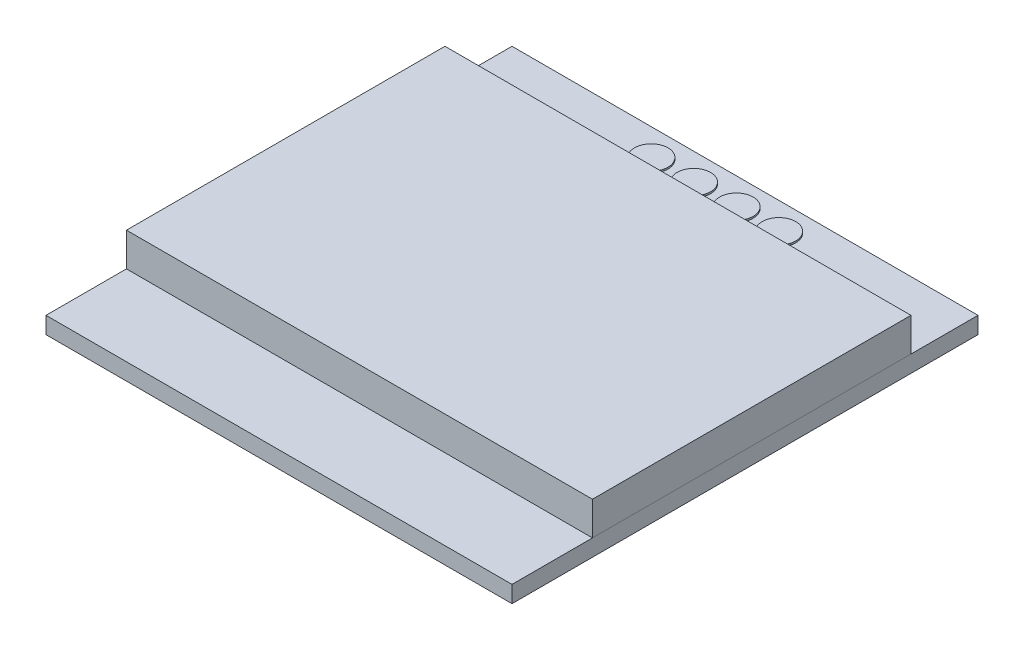
ISO-10303-21;
HEADER;
FILE_DESCRIPTION(('STEP AP214'),'2;1');
FILE_NAME('part.step','',(''),(''),'','','');
FILE_SCHEMA(('AUTOMOTIVE_DESIGN { 1 0 10303 214 1 1 1 1 }'));
ENDSEC;
DATA;
#1=APPLICATION_CONTEXT('core data for automotive mechanical design processes');
#2=APPLICATION_PROTOCOL_DEFINITION('international standard','automotive_design',2000,#1);
#3=PRODUCT_CONTEXT('',#1,'mechanical');
#4=PRODUCT('Part','Part','',(#3));
#5=PRODUCT_RELATED_PRODUCT_CATEGORY('part','',(#4));
#6=PRODUCT_DEFINITION_FORMATION('','',#4);
#7=PRODUCT_DEFINITION_CONTEXT('part definition',#1,'design');
#8=PRODUCT_DEFINITION('design','',#6,#7);
#9=PRODUCT_DEFINITION_SHAPE('','',#8);
#10=(LENGTH_UNIT() NAMED_UNIT(*) SI_UNIT(.MILLI.,.METRE.));
#11=(NAMED_UNIT(*) PLANE_ANGLE_UNIT() SI_UNIT($,.RADIAN.));
#12=(NAMED_UNIT(*) SI_UNIT($,.STERADIAN.) SOLID_ANGLE_UNIT());
#13=UNCERTAINTY_MEASURE_WITH_UNIT(LENGTH_MEASURE(1.E-05),#10,'distance_accuracy_value','');
#14=(GEOMETRIC_REPRESENTATION_CONTEXT(3) GLOBAL_UNCERTAINTY_ASSIGNED_CONTEXT((#13)) GLOBAL_UNIT_ASSIGNED_CONTEXT((#10,
#11,#12)) REPRESENTATION_CONTEXT('',''));
#15=CARTESIAN_POINT('',(0.,0.,0.));
#16=DIRECTION('',(0.,0.,1.));
#17=DIRECTION('',(1.,0.,0.));
#18=AXIS2_PLACEMENT_3D('',#15,#16,#17);
#19=CARTESIAN_POINT('',(17.62,1.1,-26.1068522600922));
#20=DIRECTION('',(0.,-1.,0.));
#21=DIRECTION('',(0.,0.,-1.));
#22=AXIS2_PLACEMENT_3D('',#19,#20,#21);
#23=CYLINDRICAL_SURFACE('',#22,1.);
#24=CARTESIAN_POINT('',(17.62,1.1,-26.1068522600922));
#25=DIRECTION('',(0.,1.,0.));
#26=DIRECTION('',(0.,0.,1.));
#27=AXIS2_PLACEMENT_3D('',#24,#25,#26);
#28=CIRCLE('',#27,1.);
#29=CARTESIAN_POINT('',(17.62,1.1,-25.1068522600922));
#30=VERTEX_POINT('',#29);
#31=EDGE_CURVE('E11',#30,#30,#28,.T.);
#32=ORIENTED_EDGE('',*,*,#31,.F.);
#33=EDGE_LOOP('',(#32));
#34=FACE_BOUND('',#33,.T.);
#35=CARTESIAN_POINT('',(17.62,1.,-26.1068522600922));
#36=DIRECTION('',(0.,1.,0.));
#37=DIRECTION('',(0.,0.,1.));
#38=AXIS2_PLACEMENT_3D('',#35,#36,#37);
#39=CIRCLE('',#38,1.);
#40=CARTESIAN_POINT('',(17.62,1.,-25.1068522600922));
#41=VERTEX_POINT('',#40);
#42=EDGE_CURVE('E45',#41,#41,#39,.T.);
#43=ORIENTED_EDGE('',*,*,#42,.T.);
#44=EDGE_LOOP('',(#43));
#45=FACE_BOUND('',#44,.T.);
#46=ADVANCED_FACE('F42',(#34,#45),#23,.T.);
#47=CARTESIAN_POINT('',(17.62,1.1,-26.1068522600922));
#48=DIRECTION('',(0.,1.,0.));
#49=DIRECTION('',(0.,0.,1.));
#50=AXIS2_PLACEMENT_3D('',#47,#48,#49);
#51=PLANE('',#50);
#52=ORIENTED_EDGE('',*,*,#31,.T.);
#53=EDGE_LOOP('',(#52));
#54=FACE_BOUND('',#53,.T.);
#55=ADVANCED_FACE('F57',(#54),#51,.T.);
#56=CARTESIAN_POINT('',(17.62,1.,-26.1068522600922));
#57=DIRECTION('',(0.,1.,0.));
#58=DIRECTION('',(0.,0.,1.));
#59=AXIS2_PLACEMENT_3D('',#56,#57,#58);
#60=PLANE('',#59);
#61=ORIENTED_EDGE('',*,*,#42,.F.);
#62=EDGE_LOOP('',(#61));
#63=FACE_BOUND('',#62,.T.);
#64=ADVANCED_FACE('F55',(#63),#60,.F.);
#65=CLOSED_SHELL('',(#46,#55,#64));
#66=MANIFOLD_SOLID_BREP('B2',#65);
#67=CARTESIAN_POINT('',(15.08,1.1,-26.1068522600922));
#68=DIRECTION('',(0.,-1.,0.));
#69=DIRECTION('',(0.,0.,-1.));
#70=AXIS2_PLACEMENT_3D('',#67,#68,#69);
#71=CYLINDRICAL_SURFACE('',#70,1.);
#72=CARTESIAN_POINT('',(15.08,1.1,-26.1068522600922));
#73=DIRECTION('',(0.,1.,0.));
#74=DIRECTION('',(0.,0.,1.));
#75=AXIS2_PLACEMENT_3D('',#72,#73,#74);
#76=CIRCLE('',#75,1.);
#77=CARTESIAN_POINT('',(15.08,1.1,-25.1068522600922));
#78=VERTEX_POINT('',#77);
#79=EDGE_CURVE('E41',#78,#78,#76,.T.);
#80=ORIENTED_EDGE('',*,*,#79,.F.);
#81=EDGE_LOOP('',(#80));
#82=FACE_BOUND('',#81,.T.);
#83=CARTESIAN_POINT('',(15.08,1.,-26.1068522600922));
#84=DIRECTION('',(0.,1.,0.));
#85=DIRECTION('',(0.,0.,1.));
#86=AXIS2_PLACEMENT_3D('',#83,#84,#85);
#87=CIRCLE('',#86,1.);
#88=CARTESIAN_POINT('',(15.08,1.,-25.1068522600922));
#89=VERTEX_POINT('',#88);
#90=EDGE_CURVE('E94',#89,#89,#87,.T.);
#91=ORIENTED_EDGE('',*,*,#90,.T.);
#92=EDGE_LOOP('',(#91));
#93=FACE_BOUND('',#92,.T.);
#94=ADVANCED_FACE('F91',(#82,#93),#71,.T.);
#95=CARTESIAN_POINT('',(15.08,1.1,-26.1068522600922));
#96=DIRECTION('',(0.,1.,0.));
#97=DIRECTION('',(0.,0.,1.));
#98=AXIS2_PLACEMENT_3D('',#95,#96,#97);
#99=PLANE('',#98);
#100=ORIENTED_EDGE('',*,*,#79,.T.);
#101=EDGE_LOOP('',(#100));
#102=FACE_BOUND('',#101,.T.);
#103=ADVANCED_FACE('F106',(#102),#99,.T.);
#104=CARTESIAN_POINT('',(15.08,1.,-26.1068522600922));
#105=DIRECTION('',(0.,1.,0.));
#106=DIRECTION('',(0.,0.,1.));
#107=AXIS2_PLACEMENT_3D('',#104,#105,#106);
#108=PLANE('',#107);
#109=ORIENTED_EDGE('',*,*,#90,.F.);
#110=EDGE_LOOP('',(#109));
#111=FACE_BOUND('',#110,.T.);
#112=ADVANCED_FACE('F104',(#111),#108,.F.);
#113=CLOSED_SHELL('',(#94,#103,#112));
#114=MANIFOLD_SOLID_BREP('B6',#113);
#115=CARTESIAN_POINT('',(12.54,1.1,-26.1068522600922));
#116=DIRECTION('',(0.,-1.,0.));
#117=DIRECTION('',(0.,0.,-1.));
#118=AXIS2_PLACEMENT_3D('',#115,#116,#117);
#119=CYLINDRICAL_SURFACE('',#118,1.);
#120=CARTESIAN_POINT('',(12.54,1.1,-26.1068522600922));
#121=DIRECTION('',(0.,1.,0.));
#122=DIRECTION('',(0.,0.,1.));
#123=AXIS2_PLACEMENT_3D('',#120,#121,#122);
#124=CIRCLE('',#123,1.);
#125=CARTESIAN_POINT('',(12.54,1.1,-25.1068522600922));
#126=VERTEX_POINT('',#125);
#127=EDGE_CURVE('E90',#126,#126,#124,.T.);
#128=ORIENTED_EDGE('',*,*,#127,.F.);
#129=EDGE_LOOP('',(#128));
#130=FACE_BOUND('',#129,.T.);
#131=CARTESIAN_POINT('',(12.54,1.,-26.1068522600922));
#132=DIRECTION('',(0.,1.,0.));
#133=DIRECTION('',(0.,0.,1.));
#134=AXIS2_PLACEMENT_3D('',#131,#132,#133);
#135=CIRCLE('',#134,1.);
#136=CARTESIAN_POINT('',(12.54,1.,-25.1068522600922));
#137=VERTEX_POINT('',#136);
#138=EDGE_CURVE('E143',#137,#137,#135,.T.);
#139=ORIENTED_EDGE('',*,*,#138,.T.);
#140=EDGE_LOOP('',(#139));
#141=FACE_BOUND('',#140,.T.);
#142=ADVANCED_FACE('F140',(#130,#141),#119,.T.);
#143=CARTESIAN_POINT('',(12.54,1.1,-26.1068522600922));
#144=DIRECTION('',(0.,1.,0.));
#145=DIRECTION('',(0.,0.,1.));
#146=AXIS2_PLACEMENT_3D('',#143,#144,#145);
#147=PLANE('',#146);
#148=ORIENTED_EDGE('',*,*,#127,.T.);
#149=EDGE_LOOP('',(#148));
#150=FACE_BOUND('',#149,.T.);
#151=ADVANCED_FACE('F155',(#150),#147,.T.);
#152=CARTESIAN_POINT('',(12.54,1.,-26.1068522600922));
#153=DIRECTION('',(0.,1.,0.));
#154=DIRECTION('',(0.,0.,1.));
#155=AXIS2_PLACEMENT_3D('',#152,#153,#154);
#156=PLANE('',#155);
#157=ORIENTED_EDGE('',*,*,#138,.F.);
#158=EDGE_LOOP('',(#157));
#159=FACE_BOUND('',#158,.T.);
#160=ADVANCED_FACE('F153',(#159),#156,.F.);
#161=CLOSED_SHELL('',(#142,#151,#160));
#162=MANIFOLD_SOLID_BREP('B36',#161);
#163=CARTESIAN_POINT('',(10.,1.1,-26.1068522600922));
#164=DIRECTION('',(0.,-1.,0.));
#165=DIRECTION('',(0.,0.,-1.));
#166=AXIS2_PLACEMENT_3D('',#163,#164,#165);
#167=CYLINDRICAL_SURFACE('',#166,1.);
#168=CARTESIAN_POINT('',(10.,1.1,-26.1068522600922));
#169=DIRECTION('',(0.,1.,0.));
#170=DIRECTION('',(0.,0.,1.));
#171=AXIS2_PLACEMENT_3D('',#168,#169,#170);
#172=CIRCLE('',#171,1.);
#173=CARTESIAN_POINT('',(10.,1.1,-25.1068522600922));
#174=VERTEX_POINT('',#173);
#175=EDGE_CURVE('E139',#174,#174,#172,.T.);
#176=ORIENTED_EDGE('',*,*,#175,.F.);
#177=EDGE_LOOP('',(#176));
#178=FACE_BOUND('',#177,.T.);
#179=CARTESIAN_POINT('',(10.,1.,-26.1068522600922));
#180=DIRECTION('',(0.,1.,0.));
#181=DIRECTION('',(0.,0.,1.));
#182=AXIS2_PLACEMENT_3D('',#179,#180,#181);
#183=CIRCLE('',#182,1.);
#184=CARTESIAN_POINT('',(10.,1.,-25.1068522600922));
#185=VERTEX_POINT('',#184);
#186=EDGE_CURVE('E194',#185,#185,#183,.T.);
#187=ORIENTED_EDGE('',*,*,#186,.T.);
#188=EDGE_LOOP('',(#187));
#189=FACE_BOUND('',#188,.T.);
#190=ADVANCED_FACE('F191',(#178,#189),#167,.T.);
#191=CARTESIAN_POINT('',(10.,1.1,-26.1068522600922));
#192=DIRECTION('',(0.,1.,0.));
#193=DIRECTION('',(0.,0.,1.));
#194=AXIS2_PLACEMENT_3D('',#191,#192,#193);
#195=PLANE('',#194);
#196=ORIENTED_EDGE('',*,*,#175,.T.);
#197=EDGE_LOOP('',(#196));
#198=FACE_BOUND('',#197,.T.);
#199=ADVANCED_FACE('F206',(#198),#195,.T.);
#200=CARTESIAN_POINT('',(10.,1.,-26.1068522600922));
#201=DIRECTION('',(0.,1.,0.));
#202=DIRECTION('',(0.,0.,1.));
#203=AXIS2_PLACEMENT_3D('',#200,#201,#202);
#204=PLANE('',#203);
#205=ORIENTED_EDGE('',*,*,#186,.F.);
#206=EDGE_LOOP('',(#205));
#207=FACE_BOUND('',#206,.T.);
#208=ADVANCED_FACE('F204',(#207),#204,.F.);
#209=CLOSED_SHELL('',(#190,#199,#208));
#210=MANIFOLD_SOLID_BREP('B85',#209);
#211=CARTESIAN_POINT('',(0.,3.,-23.8));
#212=DIRECTION('',(1.,0.,0.));
#213=DIRECTION('',(0.,0.,-1.));
#214=AXIS2_PLACEMENT_3D('',#211,#212,#213);
#215=PLANE('',#214);
#216=DIRECTION('',(0.,0.,1.));
#217=VECTOR('',#216,1.);
#218=CARTESIAN_POINT('',(0.,1.,-23.8));
#219=LINE('',#218,#217);
#220=CARTESIAN_POINT('',(0.,1.,-23.8));
#221=VERTEX_POINT('',#220);
#222=CARTESIAN_POINT('',(0.,1.,-4.8));
#223=VERTEX_POINT('',#222);
#224=EDGE_CURVE('E304',#221,#223,#219,.T.);
#225=ORIENTED_EDGE('',*,*,#224,.T.);
#226=DIRECTION('',(0.,-1.,0.));
#227=VECTOR('',#226,1.);
#228=CARTESIAN_POINT('',(0.,3.,-4.8));
#229=LINE('',#228,#227);
#230=CARTESIAN_POINT('',(0.,3.,-4.8));
#231=VERTEX_POINT('',#230);
#232=EDGE_CURVE('E189',#231,#223,#229,.T.);
#233=ORIENTED_EDGE('',*,*,#232,.F.);
#234=DIRECTION('',(0.,0.,1.));
#235=VECTOR('',#234,1.);
#236=CARTESIAN_POINT('',(0.,3.,-23.8));
#237=LINE('',#236,#235);
#238=CARTESIAN_POINT('',(0.,3.,-23.8));
#239=VERTEX_POINT('',#238);
#240=EDGE_CURVE('E292',#239,#231,#237,.T.);
#241=ORIENTED_EDGE('',*,*,#240,.F.);
#242=DIRECTION('',(0.,-1.,0.));
#243=VECTOR('',#242,1.);
#244=CARTESIAN_POINT('',(0.,3.,-23.8));
#245=LINE('',#244,#243);
#246=EDGE_CURVE('E300',#239,#221,#245,.T.);
#247=ORIENTED_EDGE('',*,*,#246,.T.);
#248=EDGE_LOOP('',(#225,#233,#241,#247));
#249=FACE_BOUND('',#248,.T.);
#250=ADVANCED_FACE('F241',(#249),#215,.F.);
#251=CARTESIAN_POINT('',(0.,3.,-4.8));
#252=DIRECTION('',(0.,0.,-1.));
#253=DIRECTION('',(-1.,0.,0.));
#254=AXIS2_PLACEMENT_3D('',#251,#252,#253);
#255=PLANE('',#254);
#256=DIRECTION('',(1.,0.,0.));
#257=VECTOR('',#256,1.);
#258=CARTESIAN_POINT('',(0.,1.,-4.8));
#259=LINE('',#258,#257);
#260=CARTESIAN_POINT('',(27.8,1.,-4.8));
#261=VERTEX_POINT('',#260);
#262=EDGE_CURVE('E296',#223,#261,#259,.T.);
#263=ORIENTED_EDGE('',*,*,#262,.T.);
#264=DIRECTION('',(0.,-1.,0.));
#265=VECTOR('',#264,1.);
#266=CARTESIAN_POINT('',(27.8,3.,-4.8));
#267=LINE('',#266,#265);
#268=CARTESIAN_POINT('',(27.8,3.,-4.8));
#269=VERTEX_POINT('',#268);
#270=EDGE_CURVE('E249',#269,#261,#267,.T.);
#271=ORIENTED_EDGE('',*,*,#270,.F.);
#272=DIRECTION('',(1.,0.,0.));
#273=VECTOR('',#272,1.);
#274=CARTESIAN_POINT('',(0.,3.,-4.8));
#275=LINE('',#274,#273);
#276=EDGE_CURVE('E287',#231,#269,#275,.T.);
#277=ORIENTED_EDGE('',*,*,#276,.F.);
#278=ORIENTED_EDGE('',*,*,#232,.T.);
#279=EDGE_LOOP('',(#263,#271,#277,#278));
#280=FACE_BOUND('',#279,.T.);
#281=ADVANCED_FACE('F295',(#280),#255,.F.);
#282=CARTESIAN_POINT('',(27.8,3.,-23.8));
#283=DIRECTION('',(-1.,0.,0.));
#284=DIRECTION('',(0.,0.,1.));
#285=AXIS2_PLACEMENT_3D('',#282,#283,#284);
#286=PLANE('',#285);
#287=DIRECTION('',(0.,0.,-1.));
#288=VECTOR('',#287,1.);
#289=CARTESIAN_POINT('',(27.8,1.,-23.8));
#290=LINE('',#289,#288);
#291=CARTESIAN_POINT('',(27.8,1.,-23.8));
#292=VERTEX_POINT('',#291);
#293=EDGE_CURVE('E274',#261,#292,#290,.T.);
#294=ORIENTED_EDGE('',*,*,#293,.T.);
#295=DIRECTION('',(0.,-1.,0.));
#296=VECTOR('',#295,1.);
#297=CARTESIAN_POINT('',(27.8,3.,-23.8));
#298=LINE('',#297,#296);
#299=CARTESIAN_POINT('',(27.8,3.,-23.8));
#300=VERTEX_POINT('',#299);
#301=EDGE_CURVE('E297',#300,#292,#298,.T.);
#302=ORIENTED_EDGE('',*,*,#301,.F.);
#303=DIRECTION('',(0.,0.,-1.));
#304=VECTOR('',#303,1.);
#305=CARTESIAN_POINT('',(27.8,3.,-23.8));
#306=LINE('',#305,#304);
#307=EDGE_CURVE('E290',#269,#300,#306,.T.);
#308=ORIENTED_EDGE('',*,*,#307,.F.);
#309=ORIENTED_EDGE('',*,*,#270,.T.);
#310=EDGE_LOOP('',(#294,#302,#308,#309));
#311=FACE_BOUND('',#310,.T.);
#312=ADVANCED_FACE('F298',(#311),#286,.F.);
#313=CARTESIAN_POINT('',(0.,3.,-23.8));
#314=DIRECTION('',(0.,0.,1.));
#315=DIRECTION('',(1.,0.,0.));
#316=AXIS2_PLACEMENT_3D('',#313,#314,#315);
#317=PLANE('',#316);
#318=DIRECTION('',(-1.,0.,0.));
#319=VECTOR('',#318,1.);
#320=CARTESIAN_POINT('',(0.,1.,-23.8));
#321=LINE('',#320,#319);
#322=EDGE_CURVE('E280',#292,#221,#321,.T.);
#323=ORIENTED_EDGE('',*,*,#322,.T.);
#324=ORIENTED_EDGE('',*,*,#246,.F.);
#325=DIRECTION('',(-1.,0.,0.));
#326=VECTOR('',#325,1.);
#327=CARTESIAN_POINT('',(0.,3.,-23.8));
#328=LINE('',#327,#326);
#329=EDGE_CURVE('E257',#300,#239,#328,.T.);
#330=ORIENTED_EDGE('',*,*,#329,.F.);
#331=ORIENTED_EDGE('',*,*,#301,.T.);
#332=EDGE_LOOP('',(#323,#324,#330,#331));
#333=FACE_BOUND('',#332,.T.);
#334=ADVANCED_FACE('F311',(#333),#317,.F.);
#335=CARTESIAN_POINT('',(0.,3.,0.));
#336=DIRECTION('',(0.,1.,0.));
#337=DIRECTION('',(0.,0.,1.));
#338=AXIS2_PLACEMENT_3D('',#335,#336,#337);
#339=PLANE('',#338);
#340=ORIENTED_EDGE('',*,*,#240,.T.);
#341=ORIENTED_EDGE('',*,*,#276,.T.);
#342=ORIENTED_EDGE('',*,*,#307,.T.);
#343=ORIENTED_EDGE('',*,*,#329,.T.);
#344=EDGE_LOOP('',(#340,#341,#342,#343));
#345=FACE_BOUND('',#344,.T.);
#346=ADVANCED_FACE('F288',(#345),#339,.T.);
#347=CARTESIAN_POINT('',(0.,1.,0.));
#348=DIRECTION('',(0.,1.,0.));
#349=DIRECTION('',(0.,0.,1.));
#350=AXIS2_PLACEMENT_3D('',#347,#348,#349);
#351=PLANE('',#350);
#352=ORIENTED_EDGE('',*,*,#224,.F.);
#353=ORIENTED_EDGE('',*,*,#322,.F.);
#354=ORIENTED_EDGE('',*,*,#293,.F.);
#355=ORIENTED_EDGE('',*,*,#262,.F.);
#356=EDGE_LOOP('',(#352,#353,#354,#355));
#357=FACE_BOUND('',#356,.T.);
#358=ADVANCED_FACE('F314',(#357),#351,.F.);
#359=CLOSED_SHELL('',(#250,#281,#312,#334,#346,#358));
#360=MANIFOLD_SOLID_BREP('B134',#359);
#361=CARTESIAN_POINT('',(0.,1.,0.));
#362=DIRECTION('',(1.,0.,0.));
#363=DIRECTION('',(0.,0.,-1.));
#364=AXIS2_PLACEMENT_3D('',#361,#362,#363);
#365=PLANE('',#364);
#366=DIRECTION('',(0.,0.,1.));
#367=VECTOR('',#366,1.);
#368=CARTESIAN_POINT('',(0.,0.,0.));
#369=LINE('',#368,#367);
#370=CARTESIAN_POINT('',(0.,0.,-27.8));
#371=VERTEX_POINT('',#370);
#372=CARTESIAN_POINT('',(0.,0.,0.));
#373=VERTEX_POINT('',#372);
#374=EDGE_CURVE('E428',#371,#373,#369,.T.);
#375=ORIENTED_EDGE('',*,*,#374,.T.);
#376=DIRECTION('',(0.,-1.,0.));
#377=VECTOR('',#376,1.);
#378=CARTESIAN_POINT('',(0.,1.,0.));
#379=LINE('',#378,#377);
#380=CARTESIAN_POINT('',(0.,1.,0.));
#381=VERTEX_POINT('',#380);
#382=EDGE_CURVE('E239',#381,#373,#379,.T.);
#383=ORIENTED_EDGE('',*,*,#382,.F.);
#384=DIRECTION('',(0.,0.,1.));
#385=VECTOR('',#384,1.);
#386=CARTESIAN_POINT('',(0.,1.,0.));
#387=LINE('',#386,#385);
#388=CARTESIAN_POINT('',(0.,1.,-27.8));
#389=VERTEX_POINT('',#388);
#390=EDGE_CURVE('E416',#389,#381,#387,.T.);
#391=ORIENTED_EDGE('',*,*,#390,.F.);
#392=DIRECTION('',(0.,-1.,0.));
#393=VECTOR('',#392,1.);
#394=CARTESIAN_POINT('',(0.,1.,-27.8));
#395=LINE('',#394,#393);
#396=EDGE_CURVE('E424',#389,#371,#395,.T.);
#397=ORIENTED_EDGE('',*,*,#396,.T.);
#398=EDGE_LOOP('',(#375,#383,#391,#397));
#399=FACE_BOUND('',#398,.T.);
#400=ADVANCED_FACE('F365',(#399),#365,.F.);
#401=CARTESIAN_POINT('',(0.,1.,0.));
#402=DIRECTION('',(0.,0.,-1.));
#403=DIRECTION('',(-1.,0.,0.));
#404=AXIS2_PLACEMENT_3D('',#401,#402,#403);
#405=PLANE('',#404);
#406=DIRECTION('',(1.,0.,0.));
#407=VECTOR('',#406,1.);
#408=CARTESIAN_POINT('',(0.,0.,0.));
#409=LINE('',#408,#407);
#410=CARTESIAN_POINT('',(27.8,0.,0.));
#411=VERTEX_POINT('',#410);
#412=EDGE_CURVE('E420',#373,#411,#409,.T.);
#413=ORIENTED_EDGE('',*,*,#412,.T.);
#414=DIRECTION('',(0.,-1.,0.));
#415=VECTOR('',#414,1.);
#416=CARTESIAN_POINT('',(27.8,1.,0.));
#417=LINE('',#416,#415);
#418=CARTESIAN_POINT('',(27.8,1.,0.));
#419=VERTEX_POINT('',#418);
#420=EDGE_CURVE('E373',#419,#411,#417,.T.);
#421=ORIENTED_EDGE('',*,*,#420,.F.);
#422=DIRECTION('',(1.,0.,0.));
#423=VECTOR('',#422,1.);
#424=CARTESIAN_POINT('',(0.,1.,0.));
#425=LINE('',#424,#423);
#426=EDGE_CURVE('E411',#381,#419,#425,.T.);
#427=ORIENTED_EDGE('',*,*,#426,.F.);
#428=ORIENTED_EDGE('',*,*,#382,.T.);
#429=EDGE_LOOP('',(#413,#421,#427,#428));
#430=FACE_BOUND('',#429,.T.);
#431=ADVANCED_FACE('F419',(#430),#405,.F.);
#432=CARTESIAN_POINT('',(27.8,1.,0.));
#433=DIRECTION('',(-1.,0.,0.));
#434=DIRECTION('',(0.,0.,1.));
#435=AXIS2_PLACEMENT_3D('',#432,#433,#434);
#436=PLANE('',#435);
#437=DIRECTION('',(0.,0.,-1.));
#438=VECTOR('',#437,1.);
#439=CARTESIAN_POINT('',(27.8,0.,0.));
#440=LINE('',#439,#438);
#441=CARTESIAN_POINT('',(27.8,0.,-27.8));
#442=VERTEX_POINT('',#441);
#443=EDGE_CURVE('E398',#411,#442,#440,.T.);
#444=ORIENTED_EDGE('',*,*,#443,.T.);
#445=DIRECTION('',(0.,-1.,0.));
#446=VECTOR('',#445,1.);
#447=CARTESIAN_POINT('',(27.8,1.,-27.8));
#448=LINE('',#447,#446);
#449=CARTESIAN_POINT('',(27.8,1.,-27.8));
#450=VERTEX_POINT('',#449);
#451=EDGE_CURVE('E421',#450,#442,#448,.T.);
#452=ORIENTED_EDGE('',*,*,#451,.F.);
#453=DIRECTION('',(0.,0.,-1.));
#454=VECTOR('',#453,1.);
#455=CARTESIAN_POINT('',(27.8,1.,0.));
#456=LINE('',#455,#454);
#457=EDGE_CURVE('E414',#419,#450,#456,.T.);
#458=ORIENTED_EDGE('',*,*,#457,.F.);
#459=ORIENTED_EDGE('',*,*,#420,.T.);
#460=EDGE_LOOP('',(#444,#452,#458,#459));
#461=FACE_BOUND('',#460,.T.);
#462=ADVANCED_FACE('F422',(#461),#436,.F.);
#463=CARTESIAN_POINT('',(0.,1.,-27.8));
#464=DIRECTION('',(0.,0.,1.));
#465=DIRECTION('',(1.,0.,0.));
#466=AXIS2_PLACEMENT_3D('',#463,#464,#465);
#467=PLANE('',#466);
#468=DIRECTION('',(-1.,0.,0.));
#469=VECTOR('',#468,1.);
#470=CARTESIAN_POINT('',(0.,0.,-27.8));
#471=LINE('',#470,#469);
#472=EDGE_CURVE('E404',#442,#371,#471,.T.);
#473=ORIENTED_EDGE('',*,*,#472,.T.);
#474=ORIENTED_EDGE('',*,*,#396,.F.);
#475=DIRECTION('',(-1.,0.,0.));
#476=VECTOR('',#475,1.);
#477=CARTESIAN_POINT('',(0.,1.,-27.8));
#478=LINE('',#477,#476);
#479=EDGE_CURVE('E381',#450,#389,#478,.T.);
#480=ORIENTED_EDGE('',*,*,#479,.F.);
#481=ORIENTED_EDGE('',*,*,#451,.T.);
#482=EDGE_LOOP('',(#473,#474,#480,#481));
#483=FACE_BOUND('',#482,.T.);
#484=ADVANCED_FACE('F435',(#483),#467,.F.);
#485=CARTESIAN_POINT('',(0.,1.,0.));
#486=DIRECTION('',(0.,-1.,0.));
#487=DIRECTION('',(0.,0.,-1.));
#488=AXIS2_PLACEMENT_3D('',#485,#486,#487);
#489=PLANE('',#488);
#490=ORIENTED_EDGE('',*,*,#390,.T.);
#491=ORIENTED_EDGE('',*,*,#426,.T.);
#492=ORIENTED_EDGE('',*,*,#457,.T.);
#493=ORIENTED_EDGE('',*,*,#479,.T.);
#494=EDGE_LOOP('',(#490,#491,#492,#493));
#495=FACE_BOUND('',#494,.T.);
#496=ADVANCED_FACE('F412',(#495),#489,.F.);
#497=CARTESIAN_POINT('',(0.,0.,0.));
#498=DIRECTION('',(0.,-1.,0.));
#499=DIRECTION('',(0.,0.,-1.));
#500=AXIS2_PLACEMENT_3D('',#497,#498,#499);
#501=PLANE('',#500);
#502=ORIENTED_EDGE('',*,*,#374,.F.);
#503=ORIENTED_EDGE('',*,*,#472,.F.);
#504=ORIENTED_EDGE('',*,*,#443,.F.);
#505=ORIENTED_EDGE('',*,*,#412,.F.);
#506=EDGE_LOOP('',(#502,#503,#504,#505));
#507=FACE_BOUND('',#506,.T.);
#508=ADVANCED_FACE('F438',(#507),#501,.T.);
#509=CLOSED_SHELL('',(#400,#431,#462,#484,#496,#508));
#510=MANIFOLD_SOLID_BREP('B183',#509);
#511=ADVANCED_BREP_SHAPE_REPRESENTATION('',(#18,#66,#114,#162,#210,#360,#510),#14);
#512=SHAPE_DEFINITION_REPRESENTATION(#9,#511);
ENDSEC;
END-ISO-10303-21;
